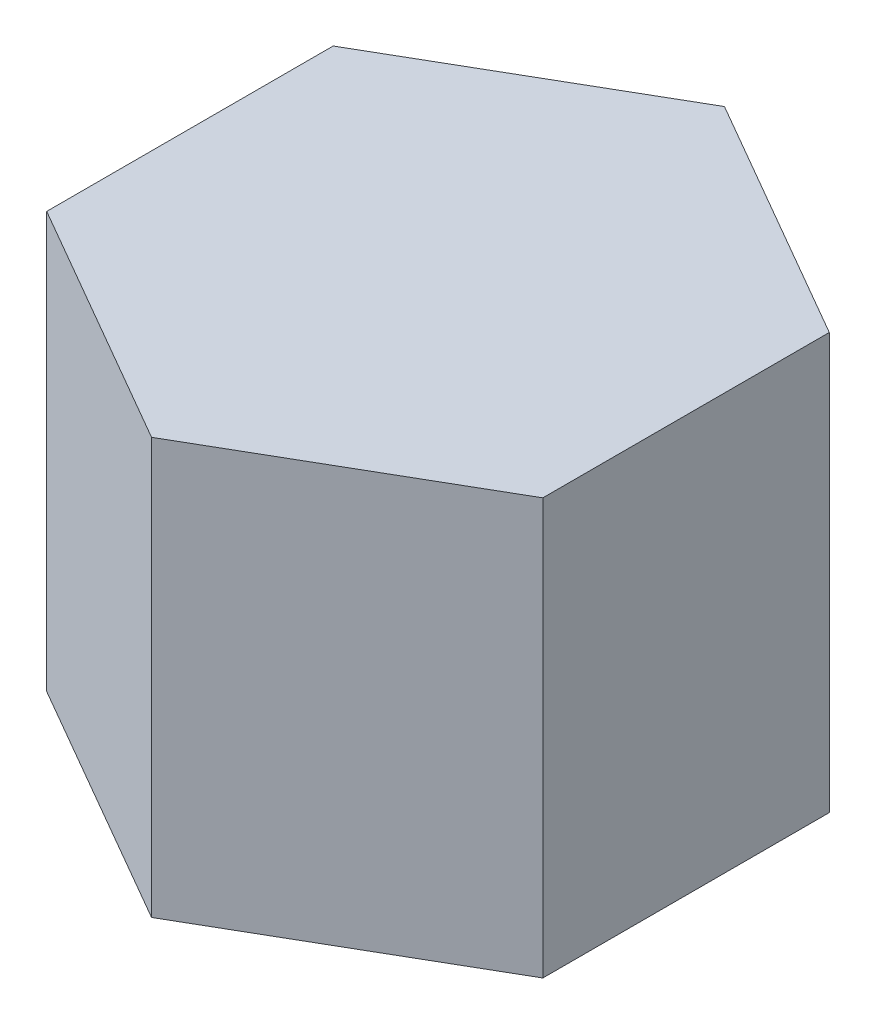
ISO-10303-21;
HEADER;
FILE_DESCRIPTION(('STEP AP214'),'2;1');
FILE_NAME('part.step','',(''),(''),'','','');
FILE_SCHEMA(('AUTOMOTIVE_DESIGN { 1 0 10303 214 1 1 1 1 }'));
ENDSEC;
DATA;
#1=APPLICATION_CONTEXT('core data for automotive mechanical design processes');
#2=APPLICATION_PROTOCOL_DEFINITION('international standard','automotive_design',2000,#1);
#3=PRODUCT_CONTEXT('',#1,'mechanical');
#4=PRODUCT('Part','Part','',(#3));
#5=PRODUCT_RELATED_PRODUCT_CATEGORY('part','',(#4));
#6=PRODUCT_DEFINITION_FORMATION('','',#4);
#7=PRODUCT_DEFINITION_CONTEXT('part definition',#1,'design');
#8=PRODUCT_DEFINITION('design','',#6,#7);
#9=PRODUCT_DEFINITION_SHAPE('','',#8);
#10=(LENGTH_UNIT() NAMED_UNIT(*) SI_UNIT(.MILLI.,.METRE.));
#11=(NAMED_UNIT(*) PLANE_ANGLE_UNIT() SI_UNIT($,.RADIAN.));
#12=(NAMED_UNIT(*) SI_UNIT($,.STERADIAN.) SOLID_ANGLE_UNIT());
#13=UNCERTAINTY_MEASURE_WITH_UNIT(LENGTH_MEASURE(1.E-05),#10,'distance_accuracy_value','');
#14=(GEOMETRIC_REPRESENTATION_CONTEXT(3) GLOBAL_UNCERTAINTY_ASSIGNED_CONTEXT((#13)) GLOBAL_UNIT_ASSIGNED_CONTEXT((#10,
#11,#12)) REPRESENTATION_CONTEXT('',''));
#15=CARTESIAN_POINT('',(0.,0.,0.));
#16=DIRECTION('',(0.,0.,1.));
#17=DIRECTION('',(1.,0.,0.));
#18=AXIS2_PLACEMENT_3D('',#15,#16,#17);
#19=CARTESIAN_POINT('',(204.642660308706,-148.537700895744,293.239022028063));
#20=DIRECTION('',(-0.499999999999909,0.,-0.866025403784491));
#21=DIRECTION('',(-0.866025403784491,0.,0.499999999999909));
#22=AXIS2_PLACEMENT_3D('',#19,#20,#21);
#23=PLANE('',#22);
#24=CARTESIAN_POINT('',(204.339551417382,-149.045793579175,293.414022028063));
#25=DIRECTION('',(0.866025403784491,0.,-0.499999999999909));
#26=VECTOR('',#25,1.);
#27=LINE('',#24,#26);
#28=CARTESIAN_POINT('',(204.339551417382,-149.045793579175,293.414022028063));
#29=VERTEX_POINT('',#28);
#30=CARTESIAN_POINT('',(204.642660308706,-149.045793579175,293.239022028063));
#31=VERTEX_POINT('',#30);
#32=EDGE_CURVE('E170',#29,#31,#27,.T.);
#33=ORIENTED_EDGE('',*,*,#32,.T.);
#34=CARTESIAN_POINT('',(204.642660308706,-148.537700895744,293.239022028063));
#35=DIRECTION('',(0.,-1.,0.));
#36=VECTOR('',#35,1.);
#37=LINE('',#34,#36);
#38=CARTESIAN_POINT('',(204.642660308706,-148.537700895744,293.239022028063));
#39=VERTEX_POINT('',#38);
#40=EDGE_CURVE('E35',#39,#31,#37,.T.);
#41=ORIENTED_EDGE('',*,*,#40,.F.);
#42=CARTESIAN_POINT('',(204.339551417382,-148.537700895744,293.414022028063));
#43=DIRECTION('',(0.866025403784491,0.,-0.499999999999909));
#44=VECTOR('',#43,1.);
#45=LINE('',#42,#44);
#46=CARTESIAN_POINT('',(204.339551417382,-148.537700895744,293.414022028063));
#47=VERTEX_POINT('',#46);
#48=EDGE_CURVE('E159',#47,#39,#45,.T.);
#49=ORIENTED_EDGE('',*,*,#48,.F.);
#50=CARTESIAN_POINT('',(204.339551417382,-148.537700895744,293.414022028063));
#51=DIRECTION('',(0.,-1.,0.));
#52=VECTOR('',#51,1.);
#53=LINE('',#50,#52);
#54=EDGE_CURVE('E10',#47,#29,#53,.T.);
#55=ORIENTED_EDGE('',*,*,#54,.T.);
#56=EDGE_LOOP('',(#33,#41,#49,#55));
#57=FACE_BOUND('',#56,.T.);
#58=ADVANCED_FACE('F16',(#57),#23,.F.);
#59=CARTESIAN_POINT('',(204.339551417382,-148.537700895744,293.414022028063));
#60=DIRECTION('',(0.500000000000062,0.,-0.866025403784403));
#61=DIRECTION('',(-0.866025403784403,0.,-0.500000000000062));
#62=AXIS2_PLACEMENT_3D('',#59,#60,#61);
#63=PLANE('',#62);
#64=CARTESIAN_POINT('',(204.036442526057,-149.045793579175,293.239022028063));
#65=DIRECTION('',(0.866025403784403,0.,0.500000000000062));
#66=VECTOR('',#65,1.);
#67=LINE('',#64,#66);
#68=CARTESIAN_POINT('',(204.036442526057,-149.045793579175,293.239022028063));
#69=VERTEX_POINT('',#68);
#70=EDGE_CURVE('E167',#69,#29,#67,.T.);
#71=ORIENTED_EDGE('',*,*,#70,.T.);
#72=ORIENTED_EDGE('',*,*,#54,.F.);
#73=CARTESIAN_POINT('',(204.036442526057,-148.537700895744,293.239022028063));
#74=DIRECTION('',(0.866025403784403,0.,0.500000000000062));
#75=VECTOR('',#74,1.);
#76=LINE('',#73,#75);
#77=CARTESIAN_POINT('',(204.036442526057,-148.537700895744,293.239022028063));
#78=VERTEX_POINT('',#77);
#79=EDGE_CURVE('E156',#78,#47,#76,.T.);
#80=ORIENTED_EDGE('',*,*,#79,.F.);
#81=CARTESIAN_POINT('',(204.036442526057,-148.537700895744,293.239022028063));
#82=DIRECTION('',(0.,-1.,0.));
#83=VECTOR('',#82,1.);
#84=LINE('',#81,#83);
#85=EDGE_CURVE('E27',#78,#69,#84,.T.);
#86=ORIENTED_EDGE('',*,*,#85,.T.);
#87=EDGE_LOOP('',(#71,#72,#80,#86));
#88=FACE_BOUND('',#87,.T.);
#89=ADVANCED_FACE('F189',(#88),#63,.F.);
#90=CARTESIAN_POINT('',(204.036442526057,-148.537700895744,290.831971220494));
#91=DIRECTION('',(1.,0.,0.));
#92=DIRECTION('',(0.,1.,0.));
#93=AXIS2_PLACEMENT_3D('',#90,#91,#92);
#94=PLANE('',#93);
#95=CARTESIAN_POINT('',(204.036442526057,-149.045793579175,292.889022028063));
#96=DIRECTION('',(0.,0.,1.));
#97=VECTOR('',#96,1.);
#98=LINE('',#95,#97);
#99=CARTESIAN_POINT('',(204.036442526057,-149.045793579175,292.889022028063));
#100=VERTEX_POINT('',#99);
#101=EDGE_CURVE('E163',#100,#69,#98,.T.);
#102=ORIENTED_EDGE('',*,*,#101,.T.);
#103=ORIENTED_EDGE('',*,*,#85,.F.);
#104=CARTESIAN_POINT('',(204.036442526057,-148.537700895744,292.889022028063));
#105=DIRECTION('',(0.,0.,1.));
#106=VECTOR('',#105,1.);
#107=LINE('',#104,#106);
#108=CARTESIAN_POINT('',(204.036442526057,-148.537700895744,292.889022028063));
#109=VERTEX_POINT('',#108);
#110=EDGE_CURVE('E106',#109,#78,#107,.T.);
#111=ORIENTED_EDGE('',*,*,#110,.F.);
#112=CARTESIAN_POINT('',(204.036442526057,-148.537700895744,292.889022028063));
#113=DIRECTION('',(0.,-1.,0.));
#114=VECTOR('',#113,1.);
#115=LINE('',#112,#114);
#116=EDGE_CURVE('E94',#109,#100,#115,.T.);
#117=ORIENTED_EDGE('',*,*,#116,.T.);
#118=EDGE_LOOP('',(#102,#103,#111,#117));
#119=FACE_BOUND('',#118,.T.);
#120=ADVANCED_FACE('F198',(#119),#94,.F.);
#121=CARTESIAN_POINT('',(204.036442526057,-148.537700895744,292.889022028063));
#122=DIRECTION('',(0.499999999999943,0.,0.866025403784472));
#123=DIRECTION('',(0.866025403784472,0.,-0.499999999999943));
#124=AXIS2_PLACEMENT_3D('',#121,#122,#123);
#125=PLANE('',#124);
#126=CARTESIAN_POINT('',(204.339551417382,-149.045793579175,292.714022028063));
#127=DIRECTION('',(-0.866025403784471,0.,0.499999999999943));
#128=VECTOR('',#127,1.);
#129=LINE('',#126,#128);
#130=CARTESIAN_POINT('',(204.339551417382,-149.045793579175,292.714022028063));
#131=VERTEX_POINT('',#130);
#132=EDGE_CURVE('E162',#131,#100,#129,.T.);
#133=ORIENTED_EDGE('',*,*,#132,.T.);
#134=ORIENTED_EDGE('',*,*,#116,.F.);
#135=CARTESIAN_POINT('',(204.339551417382,-148.537700895744,292.714022028063));
#136=DIRECTION('',(-0.866025403784471,0.,0.499999999999943));
#137=VECTOR('',#136,1.);
#138=LINE('',#135,#137);
#139=CARTESIAN_POINT('',(204.339551417382,-148.537700895744,292.714022028063));
#140=VERTEX_POINT('',#139);
#141=EDGE_CURVE('E98',#140,#109,#138,.T.);
#142=ORIENTED_EDGE('',*,*,#141,.F.);
#143=CARTESIAN_POINT('',(204.339551417382,-148.537700895744,292.714022028063));
#144=DIRECTION('',(0.,-1.,0.));
#145=VECTOR('',#144,1.);
#146=LINE('',#143,#145);
#147=EDGE_CURVE('E79',#140,#131,#146,.T.);
#148=ORIENTED_EDGE('',*,*,#147,.T.);
#149=EDGE_LOOP('',(#133,#134,#142,#148));
#150=FACE_BOUND('',#149,.T.);
#151=ADVANCED_FACE('F100',(#150),#125,.F.);
#152=CARTESIAN_POINT('',(204.339551417382,-148.537700895744,292.714022028063));
#153=DIRECTION('',(-0.500000000000096,0.,0.866025403784383));
#154=DIRECTION('',(0.866025403784383,0.,0.500000000000096));
#155=AXIS2_PLACEMENT_3D('',#152,#153,#154);
#156=PLANE('',#155);
#157=CARTESIAN_POINT('',(204.642660308706,-149.045793579175,292.889022028063));
#158=DIRECTION('',(-0.866025403784383,0.,-0.500000000000096));
#159=VECTOR('',#158,1.);
#160=LINE('',#157,#159);
#161=CARTESIAN_POINT('',(204.642660308706,-149.045793579175,292.889022028063));
#162=VERTEX_POINT('',#161);
#163=EDGE_CURVE('E88',#162,#131,#160,.T.);
#164=ORIENTED_EDGE('',*,*,#163,.T.);
#165=ORIENTED_EDGE('',*,*,#147,.F.);
#166=CARTESIAN_POINT('',(204.642660308706,-148.537700895744,292.889022028063));
#167=DIRECTION('',(-0.866025403784383,0.,-0.500000000000096));
#168=VECTOR('',#167,1.);
#169=LINE('',#166,#168);
#170=CARTESIAN_POINT('',(204.642660308706,-148.537700895744,292.889022028063));
#171=VERTEX_POINT('',#170);
#172=EDGE_CURVE('E84',#171,#140,#169,.T.);
#173=ORIENTED_EDGE('',*,*,#172,.F.);
#174=CARTESIAN_POINT('',(204.642660308706,-148.537700895744,292.889022028063));
#175=DIRECTION('',(0.,-1.,0.));
#176=VECTOR('',#175,1.);
#177=LINE('',#174,#176);
#178=EDGE_CURVE('E58',#171,#162,#177,.T.);
#179=ORIENTED_EDGE('',*,*,#178,.T.);
#180=EDGE_LOOP('',(#164,#165,#173,#179));
#181=FACE_BOUND('',#180,.T.);
#182=ADVANCED_FACE('F82',(#181),#156,.F.);
#183=CARTESIAN_POINT('',(204.642660308706,-148.537700895744,290.831971220494));
#184=DIRECTION('',(-1.,0.,0.));
#185=DIRECTION('',(0.,-1.,0.));
#186=AXIS2_PLACEMENT_3D('',#183,#184,#185);
#187=PLANE('',#186);
#188=CARTESIAN_POINT('',(204.642660308706,-149.045793579175,293.239022028063));
#189=DIRECTION('',(0.,0.,-1.));
#190=VECTOR('',#189,1.);
#191=LINE('',#188,#190);
#192=EDGE_CURVE('E160',#31,#162,#191,.T.);
#193=ORIENTED_EDGE('',*,*,#192,.T.);
#194=ORIENTED_EDGE('',*,*,#178,.F.);
#195=CARTESIAN_POINT('',(204.642660308706,-148.537700895744,293.239022028063));
#196=DIRECTION('',(0.,0.,-1.));
#197=VECTOR('',#196,1.);
#198=LINE('',#195,#197);
#199=EDGE_CURVE('E112',#39,#171,#198,.T.);
#200=ORIENTED_EDGE('',*,*,#199,.F.);
#201=ORIENTED_EDGE('',*,*,#40,.T.);
#202=EDGE_LOOP('',(#193,#194,#200,#201));
#203=FACE_BOUND('',#202,.T.);
#204=ADVANCED_FACE('F131',(#203),#187,.F.);
#205=CARTESIAN_POINT('',(206.339551417382,-148.537700895744,290.831971220494));
#206=DIRECTION('',(0.,-1.,0.));
#207=DIRECTION('',(1.,0.,0.));
#208=AXIS2_PLACEMENT_3D('',#205,#206,#207);
#209=PLANE('',#208);
#210=ORIENTED_EDGE('',*,*,#48,.T.);
#211=ORIENTED_EDGE('',*,*,#199,.T.);
#212=ORIENTED_EDGE('',*,*,#172,.T.);
#213=ORIENTED_EDGE('',*,*,#141,.T.);
#214=ORIENTED_EDGE('',*,*,#110,.T.);
#215=ORIENTED_EDGE('',*,*,#79,.T.);
#216=EDGE_LOOP('',(#210,#211,#212,#213,#214,#215));
#217=FACE_BOUND('',#216,.T.);
#218=ADVANCED_FACE('F111',(#217),#209,.F.);
#219=CARTESIAN_POINT('',(206.339551417382,-149.045793579175,290.831971220494));
#220=DIRECTION('',(0.,-1.,0.));
#221=DIRECTION('',(1.,0.,0.));
#222=AXIS2_PLACEMENT_3D('',#219,#220,#221);
#223=PLANE('',#222);
#224=ORIENTED_EDGE('',*,*,#32,.F.);
#225=ORIENTED_EDGE('',*,*,#70,.F.);
#226=ORIENTED_EDGE('',*,*,#101,.F.);
#227=ORIENTED_EDGE('',*,*,#132,.F.);
#228=ORIENTED_EDGE('',*,*,#163,.F.);
#229=ORIENTED_EDGE('',*,*,#192,.F.);
#230=EDGE_LOOP('',(#224,#225,#226,#227,#228,#229));
#231=FACE_BOUND('',#230,.T.);
#232=ADVANCED_FACE('F130',(#231),#223,.T.);
#233=CLOSED_SHELL('',(#58,#89,#120,#151,#182,#204,#218,#232));
#234=MANIFOLD_SOLID_BREP('B1',#233);
#235=ADVANCED_BREP_SHAPE_REPRESENTATION('',(#18,#234),#14);
#236=SHAPE_DEFINITION_REPRESENTATION(#9,#235);
ENDSEC;
END-ISO-10303-21;
